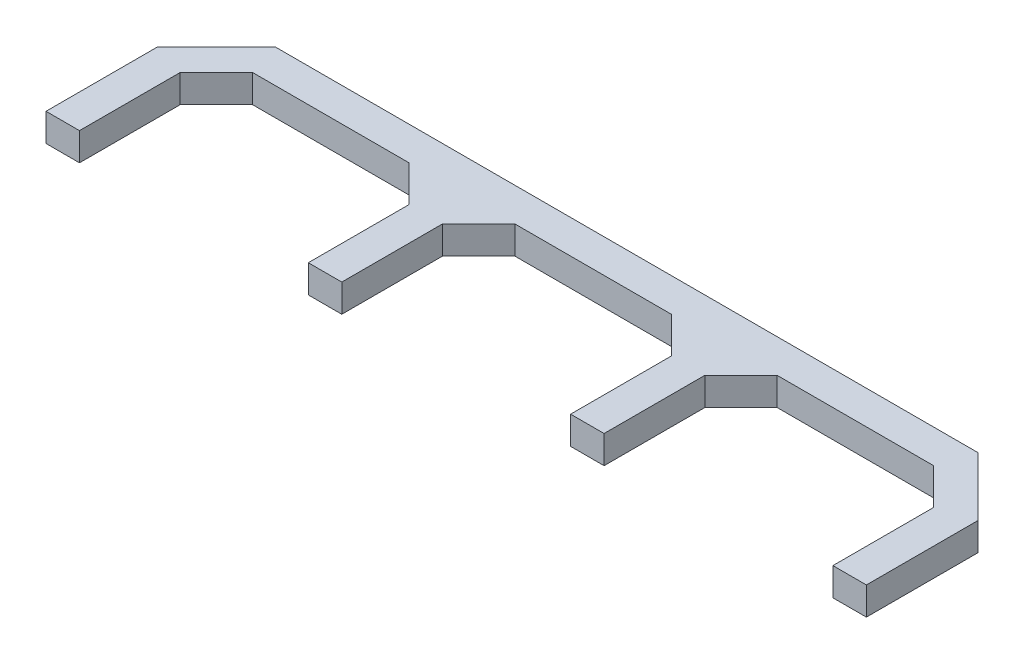
ISO-10303-21;
HEADER;
FILE_DESCRIPTION(('STEP AP214'),'2;1');
FILE_NAME('part.step','',(''),(''),'','','');
FILE_SCHEMA(('AUTOMOTIVE_DESIGN { 1 0 10303 214 1 1 1 1 }'));
ENDSEC;
DATA;
#1=APPLICATION_CONTEXT('core data for automotive mechanical design processes');
#2=APPLICATION_PROTOCOL_DEFINITION('international standard','automotive_design',2000,#1);
#3=PRODUCT_CONTEXT('',#1,'mechanical');
#4=PRODUCT('Part','Part','',(#3));
#5=PRODUCT_RELATED_PRODUCT_CATEGORY('part','',(#4));
#6=PRODUCT_DEFINITION_FORMATION('','',#4);
#7=PRODUCT_DEFINITION_CONTEXT('part definition',#1,'design');
#8=PRODUCT_DEFINITION('design','',#6,#7);
#9=PRODUCT_DEFINITION_SHAPE('','',#8);
#10=(LENGTH_UNIT() NAMED_UNIT(*) SI_UNIT(.MILLI.,.METRE.));
#11=(NAMED_UNIT(*) PLANE_ANGLE_UNIT() SI_UNIT($,.RADIAN.));
#12=(NAMED_UNIT(*) SI_UNIT($,.STERADIAN.) SOLID_ANGLE_UNIT());
#13=UNCERTAINTY_MEASURE_WITH_UNIT(LENGTH_MEASURE(1.E-05),#10,'distance_accuracy_value','');
#14=(GEOMETRIC_REPRESENTATION_CONTEXT(3) GLOBAL_UNCERTAINTY_ASSIGNED_CONTEXT((#13)) GLOBAL_UNIT_ASSIGNED_CONTEXT((#10,
#11,#12)) REPRESENTATION_CONTEXT('',''));
#15=CARTESIAN_POINT('',(0.,0.,0.));
#16=DIRECTION('',(0.,0.,1.));
#17=DIRECTION('',(1.,0.,0.));
#18=AXIS2_PLACEMENT_3D('',#15,#16,#17);
#19=CARTESIAN_POINT('',(-49.3236318746191,5.,-4.27040151210555));
#20=DIRECTION('',(1.,0.,0.));
#21=DIRECTION('',(0.,0.,-1.));
#22=AXIS2_PLACEMENT_3D('',#19,#20,#21);
#23=PLANE('',#22);
#24=DIRECTION('',(0.,0.,1.));
#25=VECTOR('',#24,1.);
#26=CARTESIAN_POINT('',(-49.3236318746191,0.,-4.27040151210555));
#27=LINE('',#26,#25);
#28=CARTESIAN_POINT('',(-49.3236318746191,0.,-24.2704015121056));
#29=VERTEX_POINT('',#28);
#30=CARTESIAN_POINT('',(-49.3236318746191,0.,-4.27040151210555));
#31=VERTEX_POINT('',#30);
#32=EDGE_CURVE('E225',#29,#31,#27,.T.);
#33=ORIENTED_EDGE('',*,*,#32,.T.);
#34=DIRECTION('',(0.,-1.,0.));
#35=VECTOR('',#34,1.);
#36=CARTESIAN_POINT('',(-49.3236318746191,5.,-4.27040151210555));
#37=LINE('',#36,#35);
#38=CARTESIAN_POINT('',(-49.3236318746191,5.,-4.27040151210555));
#39=VERTEX_POINT('',#38);
#40=EDGE_CURVE('E11',#39,#31,#37,.T.);
#41=ORIENTED_EDGE('',*,*,#40,.F.);
#42=DIRECTION('',(0.,0.,1.));
#43=VECTOR('',#42,1.);
#44=CARTESIAN_POINT('',(-49.3236318746191,5.,-4.27040151210555));
#45=LINE('',#44,#43);
#46=CARTESIAN_POINT('',(-49.3236318746191,5.,-24.2704015121056));
#47=VERTEX_POINT('',#46);
#48=EDGE_CURVE('E271',#47,#39,#45,.T.);
#49=ORIENTED_EDGE('',*,*,#48,.F.);
#50=DIRECTION('',(0.,-1.,0.));
#51=VECTOR('',#50,1.);
#52=CARTESIAN_POINT('',(-49.3236318746191,5.,-24.2704015121056));
#53=LINE('',#52,#51);
#54=EDGE_CURVE('E221',#47,#29,#53,.T.);
#55=ORIENTED_EDGE('',*,*,#54,.T.);
#56=EDGE_LOOP('',(#33,#41,#49,#55));
#57=FACE_BOUND('',#56,.T.);
#58=ADVANCED_FACE('F33',(#57),#23,.F.);
#59=CARTESIAN_POINT('',(-49.3236318746191,5.,-4.27040151210555));
#60=DIRECTION('',(0.,0.,-1.));
#61=DIRECTION('',(-1.,0.,0.));
#62=AXIS2_PLACEMENT_3D('',#59,#60,#61);
#63=PLANE('',#62);
#64=DIRECTION('',(1.,0.,0.));
#65=VECTOR('',#64,1.);
#66=CARTESIAN_POINT('',(-49.3236318746191,0.,-4.27040151210555));
#67=LINE('',#66,#65);
#68=CARTESIAN_POINT('',(-43.3236318746189,0.,-4.27040151210513));
#69=VERTEX_POINT('',#68);
#70=EDGE_CURVE('E228',#31,#69,#67,.T.);
#71=ORIENTED_EDGE('',*,*,#70,.T.);
#72=DIRECTION('',(0.,-1.,0.));
#73=VECTOR('',#72,1.);
#74=CARTESIAN_POINT('',(-43.3236318746189,5.,-4.27040151210513));
#75=LINE('',#74,#73);
#76=CARTESIAN_POINT('',(-43.3236318746189,5.,-4.27040151210513));
#77=VERTEX_POINT('',#76);
#78=EDGE_CURVE('E41',#77,#69,#75,.T.);
#79=ORIENTED_EDGE('',*,*,#78,.F.);
#80=DIRECTION('',(1.,0.,0.));
#81=VECTOR('',#80,1.);
#82=CARTESIAN_POINT('',(-49.3236318746191,5.,-4.27040151210555));
#83=LINE('',#82,#81);
#84=EDGE_CURVE('E140',#39,#77,#83,.T.);
#85=ORIENTED_EDGE('',*,*,#84,.F.);
#86=ORIENTED_EDGE('',*,*,#40,.T.);
#87=EDGE_LOOP('',(#71,#79,#85,#86));
#88=FACE_BOUND('',#87,.T.);
#89=ADVANCED_FACE('F409',(#88),#63,.F.);
#90=CARTESIAN_POINT('',(-43.3236318746189,5.,-4.27040151210513));
#91=DIRECTION('',(-1.,0.,0.));
#92=DIRECTION('',(0.,0.,1.));
#93=AXIS2_PLACEMENT_3D('',#90,#91,#92);
#94=PLANE('',#93);
#95=DIRECTION('',(0.,0.,-1.));
#96=VECTOR('',#95,1.);
#97=CARTESIAN_POINT('',(-43.3236318746189,0.,-4.27040151210513));
#98=LINE('',#97,#96);
#99=CARTESIAN_POINT('',(-43.3236318746189,0.,-22.3098484036377));
#100=VERTEX_POINT('',#99);
#101=EDGE_CURVE('E230',#69,#100,#98,.T.);
#102=ORIENTED_EDGE('',*,*,#101,.T.);
#103=DIRECTION('',(0.,-1.,0.));
#104=VECTOR('',#103,1.);
#105=CARTESIAN_POINT('',(-43.3236318746189,5.,-22.3098484036377));
#106=LINE('',#105,#104);
#107=CARTESIAN_POINT('',(-43.3236318746189,5.,-22.3098484036377));
#108=VERTEX_POINT('',#107);
#109=EDGE_CURVE('E326',#108,#100,#106,.T.);
#110=ORIENTED_EDGE('',*,*,#109,.F.);
#111=DIRECTION('',(0.,0.,-1.));
#112=VECTOR('',#111,1.);
#113=CARTESIAN_POINT('',(-43.3236318746189,5.,-4.27040151210513));
#114=LINE('',#113,#112);
#115=EDGE_CURVE('E334',#77,#108,#114,.T.);
#116=ORIENTED_EDGE('',*,*,#115,.F.);
#117=ORIENTED_EDGE('',*,*,#78,.T.);
#118=EDGE_LOOP('',(#102,#110,#116,#117));
#119=FACE_BOUND('',#118,.T.);
#120=ADVANCED_FACE('F332',(#119),#94,.F.);
#121=CARTESIAN_POINT('',(-43.3236318746189,5.,-22.3098484036377));
#122=DIRECTION('',(-0.707106781186546,0.,-0.707106781186549));
#123=DIRECTION('',(-0.707106781186549,0.,0.707106781186546));
#124=AXIS2_PLACEMENT_3D('',#121,#122,#123);
#125=PLANE('',#124);
#126=DIRECTION('',(0.707106781186549,0.,-0.707106781186546));
#127=VECTOR('',#126,1.);
#128=CARTESIAN_POINT('',(-43.3236318746189,0.,-22.3098484036377));
#129=LINE('',#128,#127);
#130=CARTESIAN_POINT('',(-36.8336450043748,0.,-28.7998352738817));
#131=VERTEX_POINT('',#130);
#132=EDGE_CURVE('E232',#100,#131,#129,.T.);
#133=ORIENTED_EDGE('',*,*,#132,.T.);
#134=DIRECTION('',(0.,-1.,0.));
#135=VECTOR('',#134,1.);
#136=CARTESIAN_POINT('',(-36.8336450043748,5.,-28.7998352738817));
#137=LINE('',#136,#135);
#138=CARTESIAN_POINT('',(-36.8336450043748,5.,-28.7998352738817));
#139=VERTEX_POINT('',#138);
#140=EDGE_CURVE('E323',#139,#131,#137,.T.);
#141=ORIENTED_EDGE('',*,*,#140,.F.);
#142=DIRECTION('',(0.707106781186549,0.,-0.707106781186546));
#143=VECTOR('',#142,1.);
#144=CARTESIAN_POINT('',(-43.3236318746189,5.,-22.3098484036377));
#145=LINE('',#144,#143);
#146=EDGE_CURVE('E352',#108,#139,#145,.T.);
#147=ORIENTED_EDGE('',*,*,#146,.F.);
#148=ORIENTED_EDGE('',*,*,#109,.T.);
#149=EDGE_LOOP('',(#133,#141,#147,#148));
#150=FACE_BOUND('',#149,.T.);
#151=ADVANCED_FACE('F343',(#150),#125,.F.);
#152=CARTESIAN_POINT('',(-36.8336450043748,5.,-28.7998352738817));
#153=DIRECTION('',(0.,0.,-1.));
#154=DIRECTION('',(-1.,0.,0.));
#155=AXIS2_PLACEMENT_3D('',#152,#153,#154);
#156=PLANE('',#155);
#157=DIRECTION('',(1.,0.,0.));
#158=VECTOR('',#157,1.);
#159=CARTESIAN_POINT('',(-36.8336450043748,0.,-28.7998352738817));
#160=LINE('',#159,#158);
#161=CARTESIAN_POINT('',(-8.81361874486281,0.,-28.7998352738817));
#162=VERTEX_POINT('',#161);
#163=EDGE_CURVE('E234',#131,#162,#160,.T.);
#164=ORIENTED_EDGE('',*,*,#163,.T.);
#165=DIRECTION('',(0.,-1.,0.));
#166=VECTOR('',#165,1.);
#167=CARTESIAN_POINT('',(-8.81361874486281,5.,-28.7998352738817));
#168=LINE('',#167,#166);
#169=CARTESIAN_POINT('',(-8.81361874486281,5.,-28.7998352738817));
#170=VERTEX_POINT('',#169);
#171=EDGE_CURVE('E320',#170,#162,#168,.T.);
#172=ORIENTED_EDGE('',*,*,#171,.F.);
#173=DIRECTION('',(1.,0.,0.));
#174=VECTOR('',#173,1.);
#175=CARTESIAN_POINT('',(-36.8336450043748,5.,-28.7998352738817));
#176=LINE('',#175,#174);
#177=EDGE_CURVE('E349',#139,#170,#176,.T.);
#178=ORIENTED_EDGE('',*,*,#177,.F.);
#179=ORIENTED_EDGE('',*,*,#140,.T.);
#180=EDGE_LOOP('',(#164,#172,#178,#179));
#181=FACE_BOUND('',#180,.T.);
#182=ADVANCED_FACE('F347',(#181),#156,.F.);
#183=CARTESIAN_POINT('',(-2.32363187461881,5.,-22.3098484036383));
#184=DIRECTION('',(0.707106781186519,0.,-0.707106781186576));
#185=DIRECTION('',(-0.707106781186576,0.,-0.707106781186519));
#186=AXIS2_PLACEMENT_3D('',#183,#184,#185);
#187=PLANE('',#186);
#188=DIRECTION('',(0.707106781186576,0.,0.707106781186519));
#189=VECTOR('',#188,1.);
#190=CARTESIAN_POINT('',(-2.32363187461881,0.,-22.3098484036383));
#191=LINE('',#190,#189);
#192=CARTESIAN_POINT('',(-2.32363187461881,0.,-22.3098484036383));
#193=VERTEX_POINT('',#192);
#194=EDGE_CURVE('E236',#162,#193,#191,.T.);
#195=ORIENTED_EDGE('',*,*,#194,.T.);
#196=DIRECTION('',(0.,-1.,0.));
#197=VECTOR('',#196,1.);
#198=CARTESIAN_POINT('',(-2.32363187461881,5.,-22.3098484036383));
#199=LINE('',#198,#197);
#200=CARTESIAN_POINT('',(-2.32363187461881,5.,-22.3098484036383));
#201=VERTEX_POINT('',#200);
#202=EDGE_CURVE('E317',#201,#193,#199,.T.);
#203=ORIENTED_EDGE('',*,*,#202,.F.);
#204=DIRECTION('',(0.707106781186576,0.,0.707106781186519));
#205=VECTOR('',#204,1.);
#206=CARTESIAN_POINT('',(-2.32363187461881,5.,-22.3098484036383));
#207=LINE('',#206,#205);
#208=EDGE_CURVE('E351',#170,#201,#207,.T.);
#209=ORIENTED_EDGE('',*,*,#208,.F.);
#210=ORIENTED_EDGE('',*,*,#171,.T.);
#211=EDGE_LOOP('',(#195,#203,#209,#210));
#212=FACE_BOUND('',#211,.T.);
#213=ADVANCED_FACE('F422',(#212),#187,.F.);
#214=CARTESIAN_POINT('',(-2.32363187461881,5.,-22.3098484036383));
#215=DIRECTION('',(1.,0.,0.));
#216=DIRECTION('',(0.,0.,-1.));
#217=AXIS2_PLACEMENT_3D('',#214,#215,#216);
#218=PLANE('',#217);
#219=DIRECTION('',(0.,0.,1.));
#220=VECTOR('',#219,1.);
#221=CARTESIAN_POINT('',(-2.32363187461881,0.,-22.3098484036383));
#222=LINE('',#221,#220);
#223=CARTESIAN_POINT('',(-2.3236318746188,0.,-4.27040151210513));
#224=VERTEX_POINT('',#223);
#225=EDGE_CURVE('E238',#193,#224,#222,.T.);
#226=ORIENTED_EDGE('',*,*,#225,.T.);
#227=DIRECTION('',(0.,-1.,0.));
#228=VECTOR('',#227,1.);
#229=CARTESIAN_POINT('',(-2.3236318746188,5.,-4.27040151210513));
#230=LINE('',#229,#228);
#231=CARTESIAN_POINT('',(-2.3236318746188,5.,-4.27040151210513));
#232=VERTEX_POINT('',#231);
#233=EDGE_CURVE('E314',#232,#224,#230,.T.);
#234=ORIENTED_EDGE('',*,*,#233,.F.);
#235=DIRECTION('',(0.,0.,1.));
#236=VECTOR('',#235,1.);
#237=CARTESIAN_POINT('',(-2.32363187461881,5.,-22.3098484036383));
#238=LINE('',#237,#236);
#239=EDGE_CURVE('E354',#201,#232,#238,.T.);
#240=ORIENTED_EDGE('',*,*,#239,.F.);
#241=ORIENTED_EDGE('',*,*,#202,.T.);
#242=EDGE_LOOP('',(#226,#234,#240,#241));
#243=FACE_BOUND('',#242,.T.);
#244=ADVANCED_FACE('F425',(#243),#218,.F.);
#245=CARTESIAN_POINT('',(-2.3236318746188,5.,-4.27040151210513));
#246=DIRECTION('',(0.,0.,-1.));
#247=DIRECTION('',(-1.,0.,0.));
#248=AXIS2_PLACEMENT_3D('',#245,#246,#247);
#249=PLANE('',#248);
#250=DIRECTION('',(1.,0.,0.));
#251=VECTOR('',#250,1.);
#252=CARTESIAN_POINT('',(-2.3236318746188,0.,-4.27040151210513));
#253=LINE('',#252,#251);
#254=CARTESIAN_POINT('',(3.6763681253812,0.,-4.27040151210513));
#255=VERTEX_POINT('',#254);
#256=EDGE_CURVE('E240',#224,#255,#253,.T.);
#257=ORIENTED_EDGE('',*,*,#256,.T.);
#258=DIRECTION('',(0.,-1.,0.));
#259=VECTOR('',#258,1.);
#260=CARTESIAN_POINT('',(3.6763681253812,5.,-4.27040151210513));
#261=LINE('',#260,#259);
#262=CARTESIAN_POINT('',(3.6763681253812,5.,-4.27040151210513));
#263=VERTEX_POINT('',#262);
#264=EDGE_CURVE('E311',#263,#255,#261,.T.);
#265=ORIENTED_EDGE('',*,*,#264,.F.);
#266=DIRECTION('',(1.,0.,0.));
#267=VECTOR('',#266,1.);
#268=CARTESIAN_POINT('',(-2.3236318746188,5.,-4.27040151210513));
#269=LINE('',#268,#267);
#270=EDGE_CURVE('E360',#232,#263,#269,.T.);
#271=ORIENTED_EDGE('',*,*,#270,.F.);
#272=ORIENTED_EDGE('',*,*,#233,.T.);
#273=EDGE_LOOP('',(#257,#265,#271,#272));
#274=FACE_BOUND('',#273,.T.);
#275=ADVANCED_FACE('F429',(#274),#249,.F.);
#276=CARTESIAN_POINT('',(3.67636812538059,5.,-22.3098484036377));
#277=DIRECTION('',(-1.,0.,0.));
#278=DIRECTION('',(0.,0.,1.));
#279=AXIS2_PLACEMENT_3D('',#276,#277,#278);
#280=PLANE('',#279);
#281=DIRECTION('',(0.,0.,-1.));
#282=VECTOR('',#281,1.);
#283=CARTESIAN_POINT('',(3.67636812538059,0.,-22.3098484036377));
#284=LINE('',#283,#282);
#285=CARTESIAN_POINT('',(3.67636812538059,0.,-22.3098484036377));
#286=VERTEX_POINT('',#285);
#287=EDGE_CURVE('E242',#255,#286,#284,.T.);
#288=ORIENTED_EDGE('',*,*,#287,.T.);
#289=DIRECTION('',(0.,-1.,0.));
#290=VECTOR('',#289,1.);
#291=CARTESIAN_POINT('',(3.67636812538059,5.,-22.3098484036377));
#292=LINE('',#291,#290);
#293=CARTESIAN_POINT('',(3.67636812538059,5.,-22.3098484036377));
#294=VERTEX_POINT('',#293);
#295=EDGE_CURVE('E308',#294,#286,#292,.T.);
#296=ORIENTED_EDGE('',*,*,#295,.F.);
#297=DIRECTION('',(0.,0.,-1.));
#298=VECTOR('',#297,1.);
#299=CARTESIAN_POINT('',(3.67636812538059,5.,-22.3098484036377));
#300=LINE('',#299,#298);
#301=EDGE_CURVE('E362',#263,#294,#300,.T.);
#302=ORIENTED_EDGE('',*,*,#301,.F.);
#303=ORIENTED_EDGE('',*,*,#264,.T.);
#304=EDGE_LOOP('',(#288,#296,#302,#303));
#305=FACE_BOUND('',#304,.T.);
#306=ADVANCED_FACE('F433',(#305),#280,.F.);
#307=CARTESIAN_POINT('',(3.67636812538059,5.,-22.3098484036377));
#308=DIRECTION('',(-0.707106781186576,0.,-0.707106781186519));
#309=DIRECTION('',(-0.707106781186519,0.,0.707106781186576));
#310=AXIS2_PLACEMENT_3D('',#307,#308,#309);
#311=PLANE('',#310);
#312=DIRECTION('',(0.707106781186519,0.,-0.707106781186576));
#313=VECTOR('',#312,1.);
#314=CARTESIAN_POINT('',(3.67636812538059,0.,-22.3098484036377));
#315=LINE('',#314,#313);
#316=CARTESIAN_POINT('',(10.1663549956243,0.,-28.7998352738819));
#317=VERTEX_POINT('',#316);
#318=EDGE_CURVE('E244',#286,#317,#315,.T.);
#319=ORIENTED_EDGE('',*,*,#318,.T.);
#320=DIRECTION('',(0.,-1.,0.));
#321=VECTOR('',#320,1.);
#322=CARTESIAN_POINT('',(10.1663549956243,5.,-28.7998352738819));
#323=LINE('',#322,#321);
#324=CARTESIAN_POINT('',(10.1663549956243,5.,-28.7998352738819));
#325=VERTEX_POINT('',#324);
#326=EDGE_CURVE('E305',#325,#317,#323,.T.);
#327=ORIENTED_EDGE('',*,*,#326,.F.);
#328=DIRECTION('',(0.707106781186519,0.,-0.707106781186576));
#329=VECTOR('',#328,1.);
#330=CARTESIAN_POINT('',(3.67636812538059,5.,-22.3098484036377));
#331=LINE('',#330,#329);
#332=EDGE_CURVE('E364',#294,#325,#331,.T.);
#333=ORIENTED_EDGE('',*,*,#332,.F.);
#334=ORIENTED_EDGE('',*,*,#295,.T.);
#335=EDGE_LOOP('',(#319,#327,#333,#334));
#336=FACE_BOUND('',#335,.T.);
#337=ADVANCED_FACE('F437',(#336),#311,.F.);
#338=CARTESIAN_POINT('',(10.1663549956243,5.,-28.7998352738819));
#339=DIRECTION('',(0.,0.,-1.));
#340=DIRECTION('',(-1.,0.,0.));
#341=AXIS2_PLACEMENT_3D('',#338,#339,#340);
#342=PLANE('',#341);
#343=DIRECTION('',(1.,0.,0.));
#344=VECTOR('',#343,1.);
#345=CARTESIAN_POINT('',(10.1663549956243,0.,-28.7998352738819));
#346=LINE('',#345,#344);
#347=CARTESIAN_POINT('',(38.1863812551382,0.,-28.7998352738821));
#348=VERTEX_POINT('',#347);
#349=EDGE_CURVE('E246',#317,#348,#346,.T.);
#350=ORIENTED_EDGE('',*,*,#349,.T.);
#351=DIRECTION('',(0.,-1.,0.));
#352=VECTOR('',#351,1.);
#353=CARTESIAN_POINT('',(38.1863812551382,5.,-28.7998352738821));
#354=LINE('',#353,#352);
#355=CARTESIAN_POINT('',(38.1863812551382,5.,-28.7998352738821));
#356=VERTEX_POINT('',#355);
#357=EDGE_CURVE('E302',#356,#348,#354,.T.);
#358=ORIENTED_EDGE('',*,*,#357,.F.);
#359=DIRECTION('',(1.,0.,0.));
#360=VECTOR('',#359,1.);
#361=CARTESIAN_POINT('',(10.1663549956243,5.,-28.7998352738819));
#362=LINE('',#361,#360);
#363=EDGE_CURVE('E366',#325,#356,#362,.T.);
#364=ORIENTED_EDGE('',*,*,#363,.F.);
#365=ORIENTED_EDGE('',*,*,#326,.T.);
#366=EDGE_LOOP('',(#350,#358,#364,#365));
#367=FACE_BOUND('',#366,.T.);
#368=ADVANCED_FACE('F441',(#367),#342,.F.);
#369=CARTESIAN_POINT('',(44.676368125382,5.,-22.3098484036379));
#370=DIRECTION('',(0.707106781186568,0.,-0.707106781186527));
#371=DIRECTION('',(-0.707106781186527,0.,-0.707106781186568));
#372=AXIS2_PLACEMENT_3D('',#369,#370,#371);
#373=PLANE('',#372);
#374=DIRECTION('',(0.707106781186527,0.,0.707106781186568));
#375=VECTOR('',#374,1.);
#376=CARTESIAN_POINT('',(44.676368125382,0.,-22.3098484036379));
#377=LINE('',#376,#375);
#378=CARTESIAN_POINT('',(44.676368125382,0.,-22.3098484036379));
#379=VERTEX_POINT('',#378);
#380=EDGE_CURVE('E248',#348,#379,#377,.T.);
#381=ORIENTED_EDGE('',*,*,#380,.T.);
#382=DIRECTION('',(0.,-1.,0.));
#383=VECTOR('',#382,1.);
#384=CARTESIAN_POINT('',(44.676368125382,5.,-22.3098484036379));
#385=LINE('',#384,#383);
#386=CARTESIAN_POINT('',(44.676368125382,5.,-22.3098484036379));
#387=VERTEX_POINT('',#386);
#388=EDGE_CURVE('E299',#387,#379,#385,.T.);
#389=ORIENTED_EDGE('',*,*,#388,.F.);
#390=DIRECTION('',(0.707106781186527,0.,0.707106781186568));
#391=VECTOR('',#390,1.);
#392=CARTESIAN_POINT('',(44.676368125382,5.,-22.3098484036379));
#393=LINE('',#392,#391);
#394=EDGE_CURVE('E368',#356,#387,#393,.T.);
#395=ORIENTED_EDGE('',*,*,#394,.F.);
#396=ORIENTED_EDGE('',*,*,#357,.T.);
#397=EDGE_LOOP('',(#381,#389,#395,#396));
#398=FACE_BOUND('',#397,.T.);
#399=ADVANCED_FACE('F445',(#398),#373,.F.);
#400=CARTESIAN_POINT('',(44.676368125382,5.,-22.3098484036379));
#401=DIRECTION('',(1.,0.,0.));
#402=DIRECTION('',(0.,0.,-1.));
#403=AXIS2_PLACEMENT_3D('',#400,#401,#402);
#404=PLANE('',#403);
#405=DIRECTION('',(0.,0.,1.));
#406=VECTOR('',#405,1.);
#407=CARTESIAN_POINT('',(44.676368125382,0.,-22.3098484036379));
#408=LINE('',#407,#406);
#409=CARTESIAN_POINT('',(44.6763681253816,0.,-4.27040151210538));
#410=VERTEX_POINT('',#409);
#411=EDGE_CURVE('E250',#379,#410,#408,.T.);
#412=ORIENTED_EDGE('',*,*,#411,.T.);
#413=DIRECTION('',(0.,-1.,0.));
#414=VECTOR('',#413,1.);
#415=CARTESIAN_POINT('',(44.6763681253816,5.,-4.27040151210538));
#416=LINE('',#415,#414);
#417=CARTESIAN_POINT('',(44.6763681253816,5.,-4.27040151210538));
#418=VERTEX_POINT('',#417);
#419=EDGE_CURVE('E296',#418,#410,#416,.T.);
#420=ORIENTED_EDGE('',*,*,#419,.F.);
#421=DIRECTION('',(0.,0.,1.));
#422=VECTOR('',#421,1.);
#423=CARTESIAN_POINT('',(44.676368125382,5.,-22.3098484036379));
#424=LINE('',#423,#422);
#425=EDGE_CURVE('E370',#387,#418,#424,.T.);
#426=ORIENTED_EDGE('',*,*,#425,.F.);
#427=ORIENTED_EDGE('',*,*,#388,.T.);
#428=EDGE_LOOP('',(#412,#420,#426,#427));
#429=FACE_BOUND('',#428,.T.);
#430=ADVANCED_FACE('F449',(#429),#404,.F.);
#431=CARTESIAN_POINT('',(50.6763681253816,5.,-4.27040151210545));
#432=DIRECTION('',(0.,0.,-1.));
#433=DIRECTION('',(-1.,0.,0.));
#434=AXIS2_PLACEMENT_3D('',#431,#432,#433);
#435=PLANE('',#434);
#436=DIRECTION('',(1.,0.,0.));
#437=VECTOR('',#436,1.);
#438=CARTESIAN_POINT('',(50.6763681253816,0.,-4.27040151210545));
#439=LINE('',#438,#437);
#440=CARTESIAN_POINT('',(50.6763681253816,0.,-4.27040151210545));
#441=VERTEX_POINT('',#440);
#442=EDGE_CURVE('E252',#410,#441,#439,.T.);
#443=ORIENTED_EDGE('',*,*,#442,.T.);
#444=DIRECTION('',(0.,-1.,0.));
#445=VECTOR('',#444,1.);
#446=CARTESIAN_POINT('',(50.6763681253816,5.,-4.27040151210545));
#447=LINE('',#446,#445);
#448=CARTESIAN_POINT('',(50.6763681253816,5.,-4.27040151210545));
#449=VERTEX_POINT('',#448);
#450=EDGE_CURVE('E293',#449,#441,#447,.T.);
#451=ORIENTED_EDGE('',*,*,#450,.F.);
#452=DIRECTION('',(1.,0.,0.));
#453=VECTOR('',#452,1.);
#454=CARTESIAN_POINT('',(50.6763681253816,5.,-4.27040151210545));
#455=LINE('',#454,#453);
#456=EDGE_CURVE('E372',#418,#449,#455,.T.);
#457=ORIENTED_EDGE('',*,*,#456,.F.);
#458=ORIENTED_EDGE('',*,*,#419,.T.);
#459=EDGE_LOOP('',(#443,#451,#457,#458));
#460=FACE_BOUND('',#459,.T.);
#461=ADVANCED_FACE('F453',(#460),#435,.F.);
#462=CARTESIAN_POINT('',(50.6763681253814,5.,-22.3098484036386));
#463=DIRECTION('',(-1.,0.,0.));
#464=DIRECTION('',(0.,0.,1.));
#465=AXIS2_PLACEMENT_3D('',#462,#463,#464);
#466=PLANE('',#465);
#467=DIRECTION('',(0.,0.,-1.));
#468=VECTOR('',#467,1.);
#469=CARTESIAN_POINT('',(50.6763681253814,0.,-22.3098484036386));
#470=LINE('',#469,#468);
#471=CARTESIAN_POINT('',(50.6763681253814,0.,-22.3098484036386));
#472=VERTEX_POINT('',#471);
#473=EDGE_CURVE('E254',#441,#472,#470,.T.);
#474=ORIENTED_EDGE('',*,*,#473,.T.);
#475=DIRECTION('',(0.,-1.,0.));
#476=VECTOR('',#475,1.);
#477=CARTESIAN_POINT('',(50.6763681253814,5.,-22.3098484036386));
#478=LINE('',#477,#476);
#479=CARTESIAN_POINT('',(50.6763681253814,5.,-22.3098484036386));
#480=VERTEX_POINT('',#479);
#481=EDGE_CURVE('E290',#480,#472,#478,.T.);
#482=ORIENTED_EDGE('',*,*,#481,.F.);
#483=DIRECTION('',(0.,0.,-1.));
#484=VECTOR('',#483,1.);
#485=CARTESIAN_POINT('',(50.6763681253814,5.,-22.3098484036386));
#486=LINE('',#485,#484);
#487=EDGE_CURVE('E374',#449,#480,#486,.T.);
#488=ORIENTED_EDGE('',*,*,#487,.F.);
#489=ORIENTED_EDGE('',*,*,#450,.T.);
#490=EDGE_LOOP('',(#474,#482,#488,#489));
#491=FACE_BOUND('',#490,.T.);
#492=ADVANCED_FACE('F457',(#491),#466,.F.);
#493=CARTESIAN_POINT('',(50.6763681253814,5.,-22.3098484036386));
#494=DIRECTION('',(-0.707106781186527,0.,-0.707106781186568));
#495=DIRECTION('',(-0.707106781186568,0.,0.707106781186527));
#496=AXIS2_PLACEMENT_3D('',#493,#494,#495);
#497=PLANE('',#496);
#498=DIRECTION('',(0.707106781186568,0.,-0.707106781186527));
#499=VECTOR('',#498,1.);
#500=CARTESIAN_POINT('',(50.6763681253814,0.,-22.3098484036386));
#501=LINE('',#500,#499);
#502=CARTESIAN_POINT('',(57.1663549956253,0.,-28.7998352738821));
#503=VERTEX_POINT('',#502);
#504=EDGE_CURVE('E256',#472,#503,#501,.T.);
#505=ORIENTED_EDGE('',*,*,#504,.T.);
#506=DIRECTION('',(0.,-1.,0.));
#507=VECTOR('',#506,1.);
#508=CARTESIAN_POINT('',(57.1663549956253,5.,-28.7998352738821));
#509=LINE('',#508,#507);
#510=CARTESIAN_POINT('',(57.1663549956253,5.,-28.7998352738821));
#511=VERTEX_POINT('',#510);
#512=EDGE_CURVE('E287',#511,#503,#509,.T.);
#513=ORIENTED_EDGE('',*,*,#512,.F.);
#514=DIRECTION('',(0.707106781186568,0.,-0.707106781186527));
#515=VECTOR('',#514,1.);
#516=CARTESIAN_POINT('',(50.6763681253814,5.,-22.3098484036386));
#517=LINE('',#516,#515);
#518=EDGE_CURVE('E376',#480,#511,#517,.T.);
#519=ORIENTED_EDGE('',*,*,#518,.F.);
#520=ORIENTED_EDGE('',*,*,#481,.T.);
#521=EDGE_LOOP('',(#505,#513,#519,#520));
#522=FACE_BOUND('',#521,.T.);
#523=ADVANCED_FACE('F461',(#522),#497,.F.);
#524=CARTESIAN_POINT('',(85.1863812551373,5.,-28.7998352738824));
#525=DIRECTION('',(0.,0.,-1.));
#526=DIRECTION('',(-1.,0.,0.));
#527=AXIS2_PLACEMENT_3D('',#524,#525,#526);
#528=PLANE('',#527);
#529=DIRECTION('',(1.,0.,0.));
#530=VECTOR('',#529,1.);
#531=CARTESIAN_POINT('',(85.1863812551373,0.,-28.7998352738824));
#532=LINE('',#531,#530);
#533=CARTESIAN_POINT('',(85.1863812551373,0.,-28.7998352738824));
#534=VERTEX_POINT('',#533);
#535=EDGE_CURVE('E258',#503,#534,#532,.T.);
#536=ORIENTED_EDGE('',*,*,#535,.T.);
#537=DIRECTION('',(0.,-1.,0.));
#538=VECTOR('',#537,1.);
#539=CARTESIAN_POINT('',(85.1863812551373,5.,-28.7998352738824));
#540=LINE('',#539,#538);
#541=CARTESIAN_POINT('',(85.1863812551373,5.,-28.7998352738824));
#542=VERTEX_POINT('',#541);
#543=EDGE_CURVE('E284',#542,#534,#540,.T.);
#544=ORIENTED_EDGE('',*,*,#543,.F.);
#545=DIRECTION('',(1.,0.,0.));
#546=VECTOR('',#545,1.);
#547=CARTESIAN_POINT('',(85.1863812551373,5.,-28.7998352738824));
#548=LINE('',#547,#546);
#549=EDGE_CURVE('E378',#511,#542,#548,.T.);
#550=ORIENTED_EDGE('',*,*,#549,.F.);
#551=ORIENTED_EDGE('',*,*,#512,.T.);
#552=EDGE_LOOP('',(#536,#544,#550,#551));
#553=FACE_BOUND('',#552,.T.);
#554=ADVANCED_FACE('F465',(#553),#528,.F.);
#555=CARTESIAN_POINT('',(91.6763681253814,5.,-22.3098484036385));
#556=DIRECTION('',(0.707106781186538,0.,-0.707106781186557));
#557=DIRECTION('',(-0.707106781186557,0.,-0.707106781186538));
#558=AXIS2_PLACEMENT_3D('',#555,#556,#557);
#559=PLANE('',#558);
#560=DIRECTION('',(0.707106781186557,0.,0.707106781186538));
#561=VECTOR('',#560,1.);
#562=CARTESIAN_POINT('',(91.6763681253814,0.,-22.3098484036385));
#563=LINE('',#562,#561);
#564=CARTESIAN_POINT('',(91.6763681253814,0.,-22.3098484036385));
#565=VERTEX_POINT('',#564);
#566=EDGE_CURVE('E260',#534,#565,#563,.T.);
#567=ORIENTED_EDGE('',*,*,#566,.T.);
#568=DIRECTION('',(0.,-1.,0.));
#569=VECTOR('',#568,1.);
#570=CARTESIAN_POINT('',(91.6763681253814,5.,-22.3098484036385));
#571=LINE('',#570,#569);
#572=CARTESIAN_POINT('',(91.6763681253814,5.,-22.3098484036385));
#573=VERTEX_POINT('',#572);
#574=EDGE_CURVE('E281',#573,#565,#571,.T.);
#575=ORIENTED_EDGE('',*,*,#574,.F.);
#576=DIRECTION('',(0.707106781186557,0.,0.707106781186538));
#577=VECTOR('',#576,1.);
#578=CARTESIAN_POINT('',(91.6763681253814,5.,-22.3098484036385));
#579=LINE('',#578,#577);
#580=EDGE_CURVE('E380',#542,#573,#579,.T.);
#581=ORIENTED_EDGE('',*,*,#580,.F.);
#582=ORIENTED_EDGE('',*,*,#543,.T.);
#583=EDGE_LOOP('',(#567,#575,#581,#582));
#584=FACE_BOUND('',#583,.T.);
#585=ADVANCED_FACE('F469',(#584),#559,.F.);
#586=CARTESIAN_POINT('',(91.6763681253817,5.,-4.27040151210593));
#587=DIRECTION('',(1.,0.,0.));
#588=DIRECTION('',(0.,0.,-1.));
#589=AXIS2_PLACEMENT_3D('',#586,#587,#588);
#590=PLANE('',#589);
#591=DIRECTION('',(0.,0.,1.));
#592=VECTOR('',#591,1.);
#593=CARTESIAN_POINT('',(91.6763681253817,0.,-4.27040151210593));
#594=LINE('',#593,#592);
#595=CARTESIAN_POINT('',(91.6763681253817,0.,-4.27040151210593));
#596=VERTEX_POINT('',#595);
#597=EDGE_CURVE('E262',#565,#596,#594,.T.);
#598=ORIENTED_EDGE('',*,*,#597,.T.);
#599=DIRECTION('',(0.,-1.,0.));
#600=VECTOR('',#599,1.);
#601=CARTESIAN_POINT('',(91.6763681253817,5.,-4.27040151210593));
#602=LINE('',#601,#600);
#603=CARTESIAN_POINT('',(91.6763681253817,5.,-4.27040151210593));
#604=VERTEX_POINT('',#603);
#605=EDGE_CURVE('E278',#604,#596,#602,.T.);
#606=ORIENTED_EDGE('',*,*,#605,.F.);
#607=DIRECTION('',(0.,0.,1.));
#608=VECTOR('',#607,1.);
#609=CARTESIAN_POINT('',(91.6763681253817,5.,-4.27040151210593));
#610=LINE('',#609,#608);
#611=EDGE_CURVE('E382',#573,#604,#610,.T.);
#612=ORIENTED_EDGE('',*,*,#611,.F.);
#613=ORIENTED_EDGE('',*,*,#574,.T.);
#614=EDGE_LOOP('',(#598,#606,#612,#613));
#615=FACE_BOUND('',#614,.T.);
#616=ADVANCED_FACE('F473',(#615),#590,.F.);
#617=CARTESIAN_POINT('',(97.6763681253819,5.,-4.27040151210642));
#618=DIRECTION('',(0.,0.,-1.));
#619=DIRECTION('',(-1.,0.,0.));
#620=AXIS2_PLACEMENT_3D('',#617,#618,#619);
#621=PLANE('',#620);
#622=DIRECTION('',(1.,0.,0.));
#623=VECTOR('',#622,1.);
#624=CARTESIAN_POINT('',(97.6763681253819,0.,-4.27040151210642));
#625=LINE('',#624,#623);
#626=CARTESIAN_POINT('',(97.6763681253819,0.,-4.27040151210642));
#627=VERTEX_POINT('',#626);
#628=EDGE_CURVE('E264',#596,#627,#625,.T.);
#629=ORIENTED_EDGE('',*,*,#628,.T.);
#630=DIRECTION('',(0.,-1.,0.));
#631=VECTOR('',#630,1.);
#632=CARTESIAN_POINT('',(97.6763681253819,5.,-4.27040151210642));
#633=LINE('',#632,#631);
#634=CARTESIAN_POINT('',(97.6763681253819,5.,-4.27040151210642));
#635=VERTEX_POINT('',#634);
#636=EDGE_CURVE('E275',#635,#627,#633,.T.);
#637=ORIENTED_EDGE('',*,*,#636,.F.);
#638=DIRECTION('',(1.,0.,0.));
#639=VECTOR('',#638,1.);
#640=CARTESIAN_POINT('',(97.6763681253819,5.,-4.27040151210642));
#641=LINE('',#640,#639);
#642=EDGE_CURVE('E384',#604,#635,#641,.T.);
#643=ORIENTED_EDGE('',*,*,#642,.F.);
#644=ORIENTED_EDGE('',*,*,#605,.T.);
#645=EDGE_LOOP('',(#629,#637,#643,#644));
#646=FACE_BOUND('',#645,.T.);
#647=ADVANCED_FACE('F390',(#646),#621,.F.);
#648=CARTESIAN_POINT('',(97.6763681253819,5.,-4.27040151210642));
#649=DIRECTION('',(-1.,0.,0.));
#650=DIRECTION('',(0.,0.,1.));
#651=AXIS2_PLACEMENT_3D('',#648,#649,#650);
#652=PLANE('',#651);
#653=DIRECTION('',(0.,0.,-1.));
#654=VECTOR('',#653,1.);
#655=CARTESIAN_POINT('',(97.6763681253819,0.,-4.27040151210642));
#656=LINE('',#655,#654);
#657=CARTESIAN_POINT('',(97.6763681253816,0.,-24.2704015121064));
#658=VERTEX_POINT('',#657);
#659=EDGE_CURVE('E266',#627,#658,#656,.T.);
#660=ORIENTED_EDGE('',*,*,#659,.T.);
#661=DIRECTION('',(0.,-1.,0.));
#662=VECTOR('',#661,1.);
#663=CARTESIAN_POINT('',(97.6763681253816,5.,-24.2704015121064));
#664=LINE('',#663,#662);
#665=CARTESIAN_POINT('',(97.6763681253816,5.,-24.2704015121064));
#666=VERTEX_POINT('',#665);
#667=EDGE_CURVE('E216',#666,#658,#664,.T.);
#668=ORIENTED_EDGE('',*,*,#667,.F.);
#669=DIRECTION('',(0.,0.,-1.));
#670=VECTOR('',#669,1.);
#671=CARTESIAN_POINT('',(97.6763681253819,5.,-4.27040151210642));
#672=LINE('',#671,#670);
#673=EDGE_CURVE('E207',#635,#666,#672,.T.);
#674=ORIENTED_EDGE('',*,*,#673,.F.);
#675=ORIENTED_EDGE('',*,*,#636,.T.);
#676=EDGE_LOOP('',(#660,#668,#674,#675));
#677=FACE_BOUND('',#676,.T.);
#678=ADVANCED_FACE('F394',(#677),#652,.F.);
#679=CARTESIAN_POINT('',(87.146934363605,5.,-34.7998352738823));
#680=DIRECTION('',(-0.707106781186523,0.,0.707106781186572));
#681=DIRECTION('',(0.707106781186572,0.,0.707106781186523));
#682=AXIS2_PLACEMENT_3D('',#679,#680,#681);
#683=PLANE('',#682);
#684=DIRECTION('',(-0.707106781186572,0.,-0.707106781186523));
#685=VECTOR('',#684,1.);
#686=CARTESIAN_POINT('',(87.146934363605,0.,-34.7998352738823));
#687=LINE('',#686,#685);
#688=CARTESIAN_POINT('',(87.146934363605,0.,-34.7998352738823));
#689=VERTEX_POINT('',#688);
#690=EDGE_CURVE('E215',#658,#689,#687,.T.);
#691=ORIENTED_EDGE('',*,*,#690,.T.);
#692=DIRECTION('',(0.,-1.,0.));
#693=VECTOR('',#692,1.);
#694=CARTESIAN_POINT('',(87.146934363605,5.,-34.7998352738823));
#695=LINE('',#694,#693);
#696=CARTESIAN_POINT('',(87.146934363605,5.,-34.7998352738823));
#697=VERTEX_POINT('',#696);
#698=EDGE_CURVE('E212',#697,#689,#695,.T.);
#699=ORIENTED_EDGE('',*,*,#698,.F.);
#700=DIRECTION('',(-0.707106781186572,0.,-0.707106781186523));
#701=VECTOR('',#700,1.);
#702=CARTESIAN_POINT('',(87.146934363605,5.,-34.7998352738823));
#703=LINE('',#702,#701);
#704=EDGE_CURVE('E201',#666,#697,#703,.T.);
#705=ORIENTED_EDGE('',*,*,#704,.F.);
#706=ORIENTED_EDGE('',*,*,#667,.T.);
#707=EDGE_LOOP('',(#691,#699,#705,#706));
#708=FACE_BOUND('',#707,.T.);
#709=ADVANCED_FACE('F213',(#708),#683,.F.);
#710=CARTESIAN_POINT('',(87.146934363605,5.,-34.7998352738823));
#711=DIRECTION('',(0.,0.,1.));
#712=DIRECTION('',(1.,0.,0.));
#713=AXIS2_PLACEMENT_3D('',#710,#711,#712);
#714=PLANE('',#713);
#715=DIRECTION('',(-1.,0.,0.));
#716=VECTOR('',#715,1.);
#717=CARTESIAN_POINT('',(87.146934363605,0.,-34.7998352738823));
#718=LINE('',#717,#716);
#719=CARTESIAN_POINT('',(-38.7941981128426,0.,-34.7998352738816));
#720=VERTEX_POINT('',#719);
#721=EDGE_CURVE('E126',#689,#720,#718,.T.);
#722=ORIENTED_EDGE('',*,*,#721,.T.);
#723=DIRECTION('',(0.,-1.,0.));
#724=VECTOR('',#723,1.);
#725=CARTESIAN_POINT('',(-38.7941981128426,5.,-34.7998352738816));
#726=LINE('',#725,#724);
#727=CARTESIAN_POINT('',(-38.7941981128426,5.,-34.7998352738816));
#728=VERTEX_POINT('',#727);
#729=EDGE_CURVE('E217',#728,#720,#726,.T.);
#730=ORIENTED_EDGE('',*,*,#729,.F.);
#731=DIRECTION('',(-1.,0.,0.));
#732=VECTOR('',#731,1.);
#733=CARTESIAN_POINT('',(87.146934363605,5.,-34.7998352738823));
#734=LINE('',#733,#732);
#735=EDGE_CURVE('E205',#697,#728,#734,.T.);
#736=ORIENTED_EDGE('',*,*,#735,.F.);
#737=ORIENTED_EDGE('',*,*,#698,.T.);
#738=EDGE_LOOP('',(#722,#730,#736,#737));
#739=FACE_BOUND('',#738,.T.);
#740=ADVANCED_FACE('F219',(#739),#714,.F.);
#741=CARTESIAN_POINT('',(-38.7941981128426,5.,-34.7998352738816));
#742=DIRECTION('',(0.707106781186531,0.,0.707106781186564));
#743=DIRECTION('',(0.707106781186564,0.,-0.707106781186531));
#744=AXIS2_PLACEMENT_3D('',#741,#742,#743);
#745=PLANE('',#744);
#746=DIRECTION('',(-0.707106781186564,0.,0.707106781186531));
#747=VECTOR('',#746,1.);
#748=CARTESIAN_POINT('',(-38.7941981128426,0.,-34.7998352738816));
#749=LINE('',#748,#747);
#750=EDGE_CURVE('E132',#720,#29,#749,.T.);
#751=ORIENTED_EDGE('',*,*,#750,.T.);
#752=ORIENTED_EDGE('',*,*,#54,.F.);
#753=DIRECTION('',(-0.707106781186564,0.,0.707106781186531));
#754=VECTOR('',#753,1.);
#755=CARTESIAN_POINT('',(-38.7941981128426,5.,-34.7998352738816));
#756=LINE('',#755,#754);
#757=EDGE_CURVE('E49',#728,#47,#756,.T.);
#758=ORIENTED_EDGE('',*,*,#757,.F.);
#759=ORIENTED_EDGE('',*,*,#729,.T.);
#760=EDGE_LOOP('',(#751,#752,#758,#759));
#761=FACE_BOUND('',#760,.T.);
#762=ADVANCED_FACE('F398',(#761),#745,.F.);
#763=CARTESIAN_POINT('',(0.,5.,0.));
#764=DIRECTION('',(0.,1.,0.));
#765=DIRECTION('',(0.,0.,1.));
#766=AXIS2_PLACEMENT_3D('',#763,#764,#765);
#767=PLANE('',#766);
#768=ORIENTED_EDGE('',*,*,#48,.T.);
#769=ORIENTED_EDGE('',*,*,#84,.T.);
#770=ORIENTED_EDGE('',*,*,#115,.T.);
#771=ORIENTED_EDGE('',*,*,#146,.T.);
#772=ORIENTED_EDGE('',*,*,#177,.T.);
#773=ORIENTED_EDGE('',*,*,#208,.T.);
#774=ORIENTED_EDGE('',*,*,#239,.T.);
#775=ORIENTED_EDGE('',*,*,#270,.T.);
#776=ORIENTED_EDGE('',*,*,#301,.T.);
#777=ORIENTED_EDGE('',*,*,#332,.T.);
#778=ORIENTED_EDGE('',*,*,#363,.T.);
#779=ORIENTED_EDGE('',*,*,#394,.T.);
#780=ORIENTED_EDGE('',*,*,#425,.T.);
#781=ORIENTED_EDGE('',*,*,#456,.T.);
#782=ORIENTED_EDGE('',*,*,#487,.T.);
#783=ORIENTED_EDGE('',*,*,#518,.T.);
#784=ORIENTED_EDGE('',*,*,#549,.T.);
#785=ORIENTED_EDGE('',*,*,#580,.T.);
#786=ORIENTED_EDGE('',*,*,#611,.T.);
#787=ORIENTED_EDGE('',*,*,#642,.T.);
#788=ORIENTED_EDGE('',*,*,#673,.T.);
#789=ORIENTED_EDGE('',*,*,#704,.T.);
#790=ORIENTED_EDGE('',*,*,#735,.T.);
#791=ORIENTED_EDGE('',*,*,#757,.T.);
#792=EDGE_LOOP('',(#768,#769,#770,#771,#772,#773,#774,#775,#776,#777,#778,#779,#780,#781,#782,
#783,#784,#785,#786,#787,#788,#789,#790,#791));
#793=FACE_BOUND('',#792,.T.);
#794=ADVANCED_FACE('F203',(#793),#767,.T.);
#795=CARTESIAN_POINT('',(0.,0.,0.));
#796=DIRECTION('',(0.,1.,0.));
#797=DIRECTION('',(0.,0.,1.));
#798=AXIS2_PLACEMENT_3D('',#795,#796,#797);
#799=PLANE('',#798);
#800=ORIENTED_EDGE('',*,*,#32,.F.);
#801=ORIENTED_EDGE('',*,*,#750,.F.);
#802=ORIENTED_EDGE('',*,*,#721,.F.);
#803=ORIENTED_EDGE('',*,*,#690,.F.);
#804=ORIENTED_EDGE('',*,*,#659,.F.);
#805=ORIENTED_EDGE('',*,*,#628,.F.);
#806=ORIENTED_EDGE('',*,*,#597,.F.);
#807=ORIENTED_EDGE('',*,*,#566,.F.);
#808=ORIENTED_EDGE('',*,*,#535,.F.);
#809=ORIENTED_EDGE('',*,*,#504,.F.);
#810=ORIENTED_EDGE('',*,*,#473,.F.);
#811=ORIENTED_EDGE('',*,*,#442,.F.);
#812=ORIENTED_EDGE('',*,*,#411,.F.);
#813=ORIENTED_EDGE('',*,*,#380,.F.);
#814=ORIENTED_EDGE('',*,*,#349,.F.);
#815=ORIENTED_EDGE('',*,*,#318,.F.);
#816=ORIENTED_EDGE('',*,*,#287,.F.);
#817=ORIENTED_EDGE('',*,*,#256,.F.);
#818=ORIENTED_EDGE('',*,*,#225,.F.);
#819=ORIENTED_EDGE('',*,*,#194,.F.);
#820=ORIENTED_EDGE('',*,*,#163,.F.);
#821=ORIENTED_EDGE('',*,*,#132,.F.);
#822=ORIENTED_EDGE('',*,*,#101,.F.);
#823=ORIENTED_EDGE('',*,*,#70,.F.);
#824=EDGE_LOOP('',(#800,#801,#802,#803,#804,#805,#806,#807,#808,#809,#810,#811,#812,#813,#814,
#815,#816,#817,#818,#819,#820,#821,#822,#823));
#825=FACE_BOUND('',#824,.T.);
#826=ADVANCED_FACE('F338',(#825),#799,.F.);
#827=CLOSED_SHELL('',(#58,#89,#120,#151,#182,#213,#244,#275,#306,#337,#368,#399,#430,#461,#492,
#523,#554,#585,#616,#647,#678,#709,#740,#762,#794,#826));
#828=MANIFOLD_SOLID_BREP('B2',#827);
#829=ADVANCED_BREP_SHAPE_REPRESENTATION('',(#18,#828),#14);
#830=SHAPE_DEFINITION_REPRESENTATION(#9,#829);
ENDSEC;
END-ISO-10303-21;
